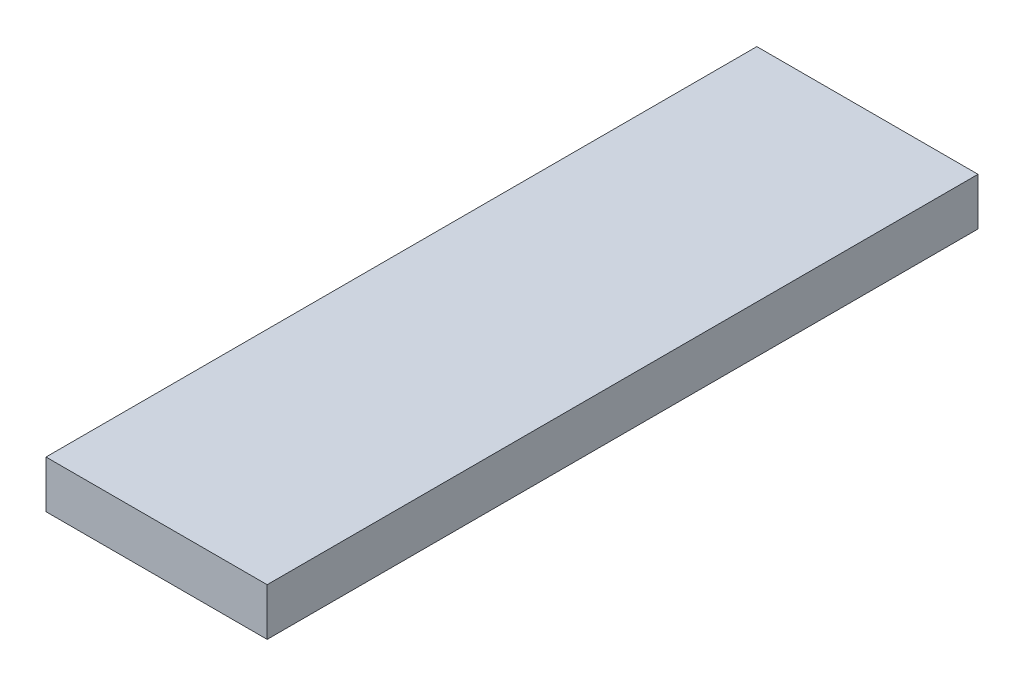
ISO-10303-21;
HEADER;
FILE_DESCRIPTION(('STEP AP214'),'2;1');
FILE_NAME('part.step','',(''),(''),'','','');
FILE_SCHEMA(('AUTOMOTIVE_DESIGN { 1 0 10303 214 1 1 1 1 }'));
ENDSEC;
DATA;
#1=APPLICATION_CONTEXT('core data for automotive mechanical design processes');
#2=APPLICATION_PROTOCOL_DEFINITION('international standard','automotive_design',2000,#1);
#3=PRODUCT_CONTEXT('',#1,'mechanical');
#4=PRODUCT('Part','Part','',(#3));
#5=PRODUCT_RELATED_PRODUCT_CATEGORY('part','',(#4));
#6=PRODUCT_DEFINITION_FORMATION('','',#4);
#7=PRODUCT_DEFINITION_CONTEXT('part definition',#1,'design');
#8=PRODUCT_DEFINITION('design','',#6,#7);
#9=PRODUCT_DEFINITION_SHAPE('','',#8);
#10=(LENGTH_UNIT() NAMED_UNIT(*) SI_UNIT(.MILLI.,.METRE.));
#11=(NAMED_UNIT(*) PLANE_ANGLE_UNIT() SI_UNIT($,.RADIAN.));
#12=(NAMED_UNIT(*) SI_UNIT($,.STERADIAN.) SOLID_ANGLE_UNIT());
#13=UNCERTAINTY_MEASURE_WITH_UNIT(LENGTH_MEASURE(1.E-05),#10,'distance_accuracy_value','');
#14=(GEOMETRIC_REPRESENTATION_CONTEXT(3) GLOBAL_UNCERTAINTY_ASSIGNED_CONTEXT((#13)) GLOBAL_UNIT_ASSIGNED_CONTEXT((#10,
#11,#12)) REPRESENTATION_CONTEXT('',''));
#15=CARTESIAN_POINT('',(0.,0.,0.));
#16=DIRECTION('',(0.,0.,1.));
#17=DIRECTION('',(1.,0.,0.));
#18=AXIS2_PLACEMENT_3D('',#15,#16,#17);
#19=CARTESIAN_POINT('',(0.,3.,0.));
#20=DIRECTION('',(1.,0.,0.));
#21=DIRECTION('',(0.,0.,-1.));
#22=AXIS2_PLACEMENT_3D('',#19,#20,#21);
#23=PLANE('',#22);
#24=DIRECTION('',(0.,0.,1.));
#25=VECTOR('',#24,1.);
#26=CARTESIAN_POINT('',(0.,0.,0.));
#27=LINE('',#26,#25);
#28=CARTESIAN_POINT('',(0.,0.,-45.));
#29=VERTEX_POINT('',#28);
#30=CARTESIAN_POINT('',(0.,0.,0.));
#31=VERTEX_POINT('',#30);
#32=EDGE_CURVE('E96',#29,#31,#27,.T.);
#33=ORIENTED_EDGE('',*,*,#32,.T.);
#34=DIRECTION('',(0.,-1.,0.));
#35=VECTOR('',#34,1.);
#36=CARTESIAN_POINT('',(0.,3.,0.));
#37=LINE('',#36,#35);
#38=CARTESIAN_POINT('',(0.,3.,0.));
#39=VERTEX_POINT('',#38);
#40=EDGE_CURVE('E11',#39,#31,#37,.T.);
#41=ORIENTED_EDGE('',*,*,#40,.F.);
#42=DIRECTION('',(0.,0.,1.));
#43=VECTOR('',#42,1.);
#44=CARTESIAN_POINT('',(0.,3.,0.));
#45=LINE('',#44,#43);
#46=CARTESIAN_POINT('',(0.,3.,-45.));
#47=VERTEX_POINT('',#46);
#48=EDGE_CURVE('E84',#47,#39,#45,.T.);
#49=ORIENTED_EDGE('',*,*,#48,.F.);
#50=DIRECTION('',(0.,-1.,0.));
#51=VECTOR('',#50,1.);
#52=CARTESIAN_POINT('',(0.,3.,-45.));
#53=LINE('',#52,#51);
#54=EDGE_CURVE('E92',#47,#29,#53,.T.);
#55=ORIENTED_EDGE('',*,*,#54,.T.);
#56=EDGE_LOOP('',(#33,#41,#49,#55));
#57=FACE_BOUND('',#56,.T.);
#58=ADVANCED_FACE('F33',(#57),#23,.F.);
#59=CARTESIAN_POINT('',(0.,3.,0.));
#60=DIRECTION('',(0.,0.,-1.));
#61=DIRECTION('',(-1.,0.,0.));
#62=AXIS2_PLACEMENT_3D('',#59,#60,#61);
#63=PLANE('',#62);
#64=DIRECTION('',(1.,0.,0.));
#65=VECTOR('',#64,1.);
#66=CARTESIAN_POINT('',(0.,0.,0.));
#67=LINE('',#66,#65);
#68=CARTESIAN_POINT('',(14.,0.,0.));
#69=VERTEX_POINT('',#68);
#70=EDGE_CURVE('E88',#31,#69,#67,.T.);
#71=ORIENTED_EDGE('',*,*,#70,.T.);
#72=DIRECTION('',(0.,-1.,0.));
#73=VECTOR('',#72,1.);
#74=CARTESIAN_POINT('',(14.,3.,0.));
#75=LINE('',#74,#73);
#76=CARTESIAN_POINT('',(14.,3.,0.));
#77=VERTEX_POINT('',#76);
#78=EDGE_CURVE('E41',#77,#69,#75,.T.);
#79=ORIENTED_EDGE('',*,*,#78,.F.);
#80=DIRECTION('',(1.,0.,0.));
#81=VECTOR('',#80,1.);
#82=CARTESIAN_POINT('',(0.,3.,0.));
#83=LINE('',#82,#81);
#84=EDGE_CURVE('E79',#39,#77,#83,.T.);
#85=ORIENTED_EDGE('',*,*,#84,.F.);
#86=ORIENTED_EDGE('',*,*,#40,.T.);
#87=EDGE_LOOP('',(#71,#79,#85,#86));
#88=FACE_BOUND('',#87,.T.);
#89=ADVANCED_FACE('F87',(#88),#63,.F.);
#90=CARTESIAN_POINT('',(14.,3.,0.));
#91=DIRECTION('',(-1.,0.,0.));
#92=DIRECTION('',(0.,0.,1.));
#93=AXIS2_PLACEMENT_3D('',#90,#91,#92);
#94=PLANE('',#93);
#95=DIRECTION('',(0.,0.,-1.));
#96=VECTOR('',#95,1.);
#97=CARTESIAN_POINT('',(14.,0.,0.));
#98=LINE('',#97,#96);
#99=CARTESIAN_POINT('',(14.,0.,-45.));
#100=VERTEX_POINT('',#99);
#101=EDGE_CURVE('E66',#69,#100,#98,.T.);
#102=ORIENTED_EDGE('',*,*,#101,.T.);
#103=DIRECTION('',(0.,-1.,0.));
#104=VECTOR('',#103,1.);
#105=CARTESIAN_POINT('',(14.,3.,-45.));
#106=LINE('',#105,#104);
#107=CARTESIAN_POINT('',(14.,3.,-45.));
#108=VERTEX_POINT('',#107);
#109=EDGE_CURVE('E89',#108,#100,#106,.T.);
#110=ORIENTED_EDGE('',*,*,#109,.F.);
#111=DIRECTION('',(0.,0.,-1.));
#112=VECTOR('',#111,1.);
#113=CARTESIAN_POINT('',(14.,3.,0.));
#114=LINE('',#113,#112);
#115=EDGE_CURVE('E82',#77,#108,#114,.T.);
#116=ORIENTED_EDGE('',*,*,#115,.F.);
#117=ORIENTED_EDGE('',*,*,#78,.T.);
#118=EDGE_LOOP('',(#102,#110,#116,#117));
#119=FACE_BOUND('',#118,.T.);
#120=ADVANCED_FACE('F90',(#119),#94,.F.);
#121=CARTESIAN_POINT('',(0.,3.,-45.));
#122=DIRECTION('',(0.,0.,1.));
#123=DIRECTION('',(1.,0.,0.));
#124=AXIS2_PLACEMENT_3D('',#121,#122,#123);
#125=PLANE('',#124);
#126=DIRECTION('',(-1.,0.,0.));
#127=VECTOR('',#126,1.);
#128=CARTESIAN_POINT('',(0.,0.,-45.));
#129=LINE('',#128,#127);
#130=EDGE_CURVE('E72',#100,#29,#129,.T.);
#131=ORIENTED_EDGE('',*,*,#130,.T.);
#132=ORIENTED_EDGE('',*,*,#54,.F.);
#133=DIRECTION('',(-1.,0.,0.));
#134=VECTOR('',#133,1.);
#135=CARTESIAN_POINT('',(0.,3.,-45.));
#136=LINE('',#135,#134);
#137=EDGE_CURVE('E49',#108,#47,#136,.T.);
#138=ORIENTED_EDGE('',*,*,#137,.F.);
#139=ORIENTED_EDGE('',*,*,#109,.T.);
#140=EDGE_LOOP('',(#131,#132,#138,#139));
#141=FACE_BOUND('',#140,.T.);
#142=ADVANCED_FACE('F103',(#141),#125,.F.);
#143=CARTESIAN_POINT('',(0.,3.,0.));
#144=DIRECTION('',(0.,-1.,0.));
#145=DIRECTION('',(0.,0.,-1.));
#146=AXIS2_PLACEMENT_3D('',#143,#144,#145);
#147=PLANE('',#146);
#148=ORIENTED_EDGE('',*,*,#48,.T.);
#149=ORIENTED_EDGE('',*,*,#84,.T.);
#150=ORIENTED_EDGE('',*,*,#115,.T.);
#151=ORIENTED_EDGE('',*,*,#137,.T.);
#152=EDGE_LOOP('',(#148,#149,#150,#151));
#153=FACE_BOUND('',#152,.T.);
#154=ADVANCED_FACE('F80',(#153),#147,.F.);
#155=CARTESIAN_POINT('',(0.,0.,0.));
#156=DIRECTION('',(0.,-1.,0.));
#157=DIRECTION('',(0.,0.,-1.));
#158=AXIS2_PLACEMENT_3D('',#155,#156,#157);
#159=PLANE('',#158);
#160=ORIENTED_EDGE('',*,*,#32,.F.);
#161=ORIENTED_EDGE('',*,*,#130,.F.);
#162=ORIENTED_EDGE('',*,*,#101,.F.);
#163=ORIENTED_EDGE('',*,*,#70,.F.);
#164=EDGE_LOOP('',(#160,#161,#162,#163));
#165=FACE_BOUND('',#164,.T.);
#166=ADVANCED_FACE('F106',(#165),#159,.T.);
#167=CLOSED_SHELL('',(#58,#89,#120,#142,#154,#166));
#168=MANIFOLD_SOLID_BREP('B2',#167);
#169=ADVANCED_BREP_SHAPE_REPRESENTATION('',(#18,#168),#14);
#170=SHAPE_DEFINITION_REPRESENTATION(#9,#169);
ENDSEC;
END-ISO-10303-21;
